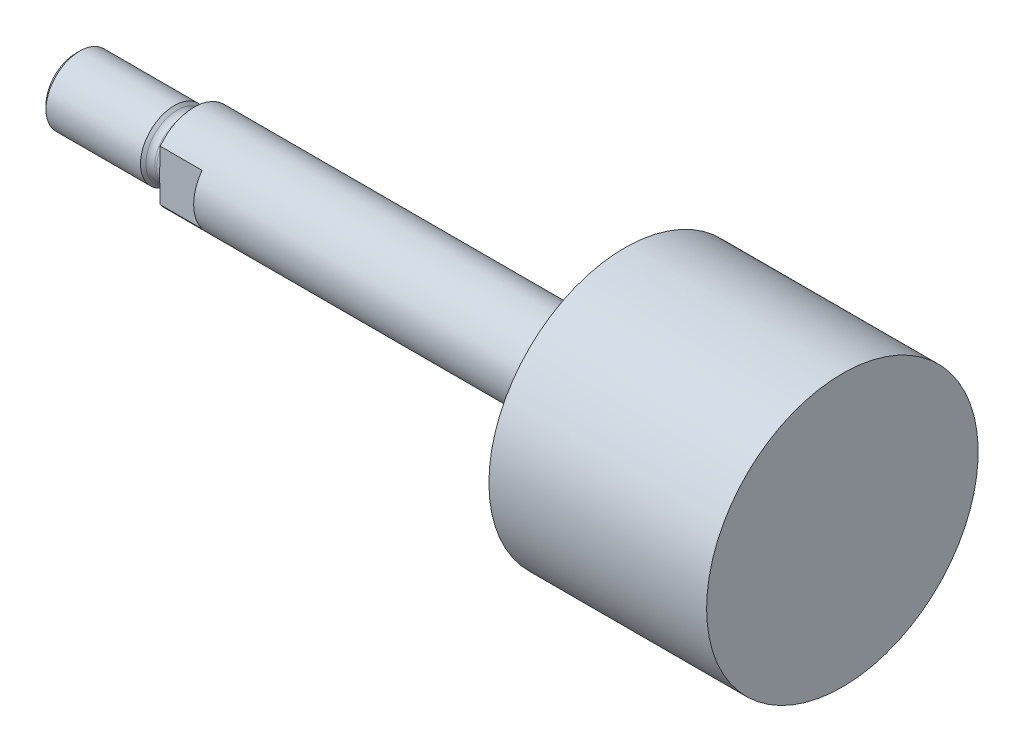
ISO-10303-21;
HEADER;
FILE_DESCRIPTION(('STEP AP214'),'2;1');
FILE_NAME('part.step','',(''),(''),'','','');
FILE_SCHEMA(('AUTOMOTIVE_DESIGN { 1 0 10303 214 1 1 1 1 }'));
ENDSEC;
DATA;
#1=APPLICATION_CONTEXT('core data for automotive mechanical design processes');
#2=APPLICATION_PROTOCOL_DEFINITION('international standard','automotive_design',2000,#1);
#3=PRODUCT_CONTEXT('',#1,'mechanical');
#4=PRODUCT('Part','Part','',(#3));
#5=PRODUCT_RELATED_PRODUCT_CATEGORY('part','',(#4));
#6=PRODUCT_DEFINITION_FORMATION('','',#4);
#7=PRODUCT_DEFINITION_CONTEXT('part definition',#1,'design');
#8=PRODUCT_DEFINITION('design','',#6,#7);
#9=PRODUCT_DEFINITION_SHAPE('','',#8);
#10=(LENGTH_UNIT() NAMED_UNIT(*) SI_UNIT(.MILLI.,.METRE.));
#11=(NAMED_UNIT(*) PLANE_ANGLE_UNIT() SI_UNIT($,.RADIAN.));
#12=(NAMED_UNIT(*) SI_UNIT($,.STERADIAN.) SOLID_ANGLE_UNIT());
#13=UNCERTAINTY_MEASURE_WITH_UNIT(LENGTH_MEASURE(1.E-05),#10,'distance_accuracy_value','');
#14=(GEOMETRIC_REPRESENTATION_CONTEXT(3) GLOBAL_UNCERTAINTY_ASSIGNED_CONTEXT((#13)) GLOBAL_UNIT_ASSIGNED_CONTEXT((#10,
#11,#12)) REPRESENTATION_CONTEXT('',''));
#15=CARTESIAN_POINT('',(0.,0.,0.));
#16=DIRECTION('',(0.,0.,1.));
#17=DIRECTION('',(1.,0.,0.));
#18=AXIS2_PLACEMENT_3D('',#15,#16,#17);
#19=CARTESIAN_POINT('',(-9.525,0.,0.));
#20=DIRECTION('',(1.,0.,0.));
#21=DIRECTION('',(0.,0.,-1.));
#22=AXIS2_PLACEMENT_3D('',#19,#20,#21);
#23=PLANE('',#22);
#24=CARTESIAN_POINT('',(-9.52500000000001,0.,0.));
#25=DIRECTION('',(-1.,0.,0.));
#26=DIRECTION('',(0.,0.,1.));
#27=AXIS2_PLACEMENT_3D('',#24,#25,#26);
#28=CIRCLE('',#27,7.9375);
#29=CARTESIAN_POINT('',(-9.52500000000001,-4.7625,-6.35));
#30=VERTEX_POINT('',#29);
#31=CARTESIAN_POINT('',(-9.52500000000001,-4.7625,6.35));
#32=VERTEX_POINT('',#31);
#33=EDGE_CURVE('E106',#30,#32,#28,.T.);
#34=ORIENTED_EDGE('',*,*,#33,.T.);
#35=DIRECTION('',(0.,1.,0.));
#36=VECTOR('',#35,1.);
#37=CARTESIAN_POINT('',(-9.525,0.,6.35));
#38=LINE('',#37,#36);
#39=CARTESIAN_POINT('',(-9.52499999999909,-2.97038855370794,6.35));
#40=VERTEX_POINT('',#39);
#41=EDGE_CURVE('E114',#32,#40,#38,.T.);
#42=ORIENTED_EDGE('',*,*,#41,.T.);
#43=CARTESIAN_POINT('',(-9.525,0.,0.));
#44=DIRECTION('',(-1.,0.,0.));
#45=DIRECTION('',(0.,0.,1.));
#46=AXIS2_PLACEMENT_3D('',#43,#44,#45);
#47=CIRCLE('',#46,7.01039999999997);
#48=CARTESIAN_POINT('',(-9.525,-2.970388553708,-6.35));
#49=VERTEX_POINT('',#48);
#50=EDGE_CURVE('E149',#49,#40,#47,.T.);
#51=ORIENTED_EDGE('',*,*,#50,.F.);
#52=DIRECTION('',(0.,-1.,0.));
#53=VECTOR('',#52,1.);
#54=CARTESIAN_POINT('',(-9.525,0.,-6.35));
#55=LINE('',#54,#53);
#56=EDGE_CURVE('E51',#49,#30,#55,.T.);
#57=ORIENTED_EDGE('',*,*,#56,.T.);
#58=EDGE_LOOP('',(#34,#42,#51,#57));
#59=FACE_BOUND('',#58,.T.);
#60=ADVANCED_FACE('F36',(#59),#23,.F.);
#61=CARTESIAN_POINT('',(-9.525,2.970388553708,6.35));
#62=VERTEX_POINT('',#61);
#63=CARTESIAN_POINT('',(-9.52499999999909,2.97038855370794,-6.35));
#64=VERTEX_POINT('',#63);
#65=EDGE_CURVE('E150',#62,#64,#47,.T.);
#66=ORIENTED_EDGE('',*,*,#65,.F.);
#67=CARTESIAN_POINT('',(-9.52500000000001,4.7625,6.35));
#68=VERTEX_POINT('',#67);
#69=EDGE_CURVE('E59',#62,#68,#38,.T.);
#70=ORIENTED_EDGE('',*,*,#69,.T.);
#71=CARTESIAN_POINT('',(-9.52500000000001,4.7625,-6.35));
#72=VERTEX_POINT('',#71);
#73=EDGE_CURVE('E147',#68,#72,#28,.T.);
#74=ORIENTED_EDGE('',*,*,#73,.T.);
#75=EDGE_CURVE('E107',#72,#64,#55,.T.);
#76=ORIENTED_EDGE('',*,*,#75,.T.);
#77=EDGE_LOOP('',(#66,#70,#74,#76));
#78=FACE_BOUND('',#77,.T.);
#79=ADVANCED_FACE('F38',(#78),#23,.F.);
#80=CARTESIAN_POINT('',(112.3442,0.,0.));
#81=DIRECTION('',(-1.,0.,0.));
#82=DIRECTION('',(0.,0.,1.));
#83=AXIS2_PLACEMENT_3D('',#80,#81,#82);
#84=CYLINDRICAL_SURFACE('',#83,7.9375);
#85=DIRECTION('',(-1.,0.,0.));
#86=VECTOR('',#85,1.);
#87=CARTESIAN_POINT('',(112.3442,4.7625,-6.35));
#88=LINE('',#87,#86);
#89=CARTESIAN_POINT('',(-1.651,4.7625,-6.35));
#90=VERTEX_POINT('',#89);
#91=EDGE_CURVE('E99',#90,#72,#88,.T.);
#92=ORIENTED_EDGE('',*,*,#91,.T.);
#93=ORIENTED_EDGE('',*,*,#73,.F.);
#94=DIRECTION('',(-1.,0.,0.));
#95=VECTOR('',#94,1.);
#96=CARTESIAN_POINT('',(112.3442,4.7625,6.35));
#97=LINE('',#96,#95);
#98=CARTESIAN_POINT('',(-1.651,4.7625,6.35));
#99=VERTEX_POINT('',#98);
#100=EDGE_CURVE('E115',#68,#99,#97,.F.);
#101=ORIENTED_EDGE('',*,*,#100,.T.);
#102=CARTESIAN_POINT('',(-1.651,0.,0.));
#103=DIRECTION('',(1.,0.,0.));
#104=DIRECTION('',(0.,0.,-1.));
#105=AXIS2_PLACEMENT_3D('',#102,#103,#104);
#106=CIRCLE('',#105,7.9375);
#107=CARTESIAN_POINT('',(-1.651,-4.7625,6.35));
#108=VERTEX_POINT('',#107);
#109=EDGE_CURVE('E11',#99,#108,#106,.T.);
#110=ORIENTED_EDGE('',*,*,#109,.T.);
#111=DIRECTION('',(-1.,0.,0.));
#112=VECTOR('',#111,1.);
#113=CARTESIAN_POINT('',(112.3442,-4.7625,6.35));
#114=LINE('',#113,#112);
#115=EDGE_CURVE('E118',#108,#32,#114,.T.);
#116=ORIENTED_EDGE('',*,*,#115,.T.);
#117=ORIENTED_EDGE('',*,*,#33,.F.);
#118=DIRECTION('',(-1.,0.,0.));
#119=VECTOR('',#118,1.);
#120=CARTESIAN_POINT('',(112.3442,-4.7625,-6.35));
#121=LINE('',#120,#119);
#122=CARTESIAN_POINT('',(-1.651,-4.7625,-6.35));
#123=VERTEX_POINT('',#122);
#124=EDGE_CURVE('E97',#30,#123,#121,.F.);
#125=ORIENTED_EDGE('',*,*,#124,.T.);
#126=EDGE_CURVE('E40',#123,#90,#106,.T.);
#127=ORIENTED_EDGE('',*,*,#126,.T.);
#128=EDGE_LOOP('',(#92,#93,#101,#110,#116,#117,#125,#127));
#129=FACE_BOUND('',#128,.T.);
#130=CARTESIAN_POINT('',(71.4248,0.,0.));
#131=DIRECTION('',(-1.,0.,0.));
#132=DIRECTION('',(0.,0.,1.));
#133=AXIS2_PLACEMENT_3D('',#130,#131,#132);
#134=CIRCLE('',#133,7.9375);
#135=CARTESIAN_POINT('',(71.4248,0.,7.9375));
#136=VERTEX_POINT('',#135);
#137=EDGE_CURVE('E144',#136,#136,#134,.T.);
#138=ORIENTED_EDGE('',*,*,#137,.T.);
#139=EDGE_LOOP('',(#138));
#140=FACE_BOUND('',#139,.T.);
#141=ADVANCED_FACE('F103',(#129,#140),#84,.T.);
#142=CARTESIAN_POINT('',(71.4248,7.9375,0.));
#143=DIRECTION('',(1.,0.,0.));
#144=DIRECTION('',(0.,0.,-1.));
#145=AXIS2_PLACEMENT_3D('',#142,#143,#144);
#146=PLANE('',#145);
#147=ORIENTED_EDGE('',*,*,#137,.F.);
#148=EDGE_LOOP('',(#147));
#149=FACE_BOUND('',#148,.T.);
#150=CARTESIAN_POINT('',(71.4248,0.,0.));
#151=DIRECTION('',(-1.,0.,0.));
#152=DIRECTION('',(0.,0.,1.));
#153=AXIS2_PLACEMENT_3D('',#150,#151,#152);
#154=CIRCLE('',#153,25.52065);
#155=CARTESIAN_POINT('',(71.4248,0.,25.52065));
#156=VERTEX_POINT('',#155);
#157=EDGE_CURVE('E141',#156,#156,#154,.T.);
#158=ORIENTED_EDGE('',*,*,#157,.T.);
#159=EDGE_LOOP('',(#158));
#160=FACE_BOUND('',#159,.T.);
#161=ADVANCED_FACE('F223',(#149,#160),#146,.F.);
#162=CARTESIAN_POINT('',(112.3442,0.,0.));
#163=DIRECTION('',(-1.,0.,0.));
#164=DIRECTION('',(0.,0.,1.));
#165=AXIS2_PLACEMENT_3D('',#162,#163,#164);
#166=CYLINDRICAL_SURFACE('',#165,25.52065);
#167=ORIENTED_EDGE('',*,*,#157,.F.);
#168=EDGE_LOOP('',(#167));
#169=FACE_BOUND('',#168,.T.);
#170=CARTESIAN_POINT('',(112.3442,0.,0.));
#171=DIRECTION('',(-1.,0.,0.));
#172=DIRECTION('',(0.,0.,1.));
#173=AXIS2_PLACEMENT_3D('',#170,#171,#172);
#174=CIRCLE('',#173,25.52065);
#175=CARTESIAN_POINT('',(112.3442,0.,25.52065));
#176=VERTEX_POINT('',#175);
#177=EDGE_CURVE('E138',#176,#176,#174,.T.);
#178=ORIENTED_EDGE('',*,*,#177,.T.);
#179=EDGE_LOOP('',(#178));
#180=FACE_BOUND('',#179,.T.);
#181=ADVANCED_FACE('F227',(#169,#180),#166,.T.);
#182=CARTESIAN_POINT('',(112.3442,25.52065,0.));
#183=DIRECTION('',(-1.,0.,0.));
#184=DIRECTION('',(0.,0.,1.));
#185=AXIS2_PLACEMENT_3D('',#182,#183,#184);
#186=PLANE('',#185);
#187=ORIENTED_EDGE('',*,*,#177,.F.);
#188=EDGE_LOOP('',(#187));
#189=FACE_BOUND('',#188,.T.);
#190=ADVANCED_FACE('F200',(#189),#186,.F.);
#191=CARTESIAN_POINT('',(-11.176,0.,0.));
#192=DIRECTION('',(-1.,0.,0.));
#193=DIRECTION('',(0.,0.,1.));
#194=AXIS2_PLACEMENT_3D('',#191,#192,#193);
#195=TOROIDAL_SURFACE('',#194,7.01039999999997,1.65099999999996);
#196=CARTESIAN_POINT('',(-11.176,0.,0.));
#197=DIRECTION('',(-1.,0.,0.));
#198=DIRECTION('',(0.,0.,1.));
#199=AXIS2_PLACEMENT_3D('',#196,#197,#198);
#200=CIRCLE('',#199,5.3594);
#201=CARTESIAN_POINT('',(-11.176,0.,5.3594));
#202=VERTEX_POINT('',#201);
#203=EDGE_CURVE('E135',#202,#202,#200,.T.);
#204=ORIENTED_EDGE('',*,*,#203,.F.);
#205=EDGE_LOOP('',(#204));
#206=FACE_BOUND('',#205,.T.);
#207=ORIENTED_EDGE('',*,*,#50,.T.);
#208=CARTESIAN_POINT('',(-9.66283350552548,0.,6.35));
#209=CARTESIAN_POINT('',(-9.66283776268165,0.137451430435917,6.35));
#210=CARTESIAN_POINT('',(-9.66086064410943,0.274901459292685,6.35));
#211=CARTESIAN_POINT('',(-9.65327512758972,0.549703593251603,6.35));
#212=CARTESIAN_POINT('',(-9.64766654215389,0.687055692931226,6.35));
#213=CARTESIAN_POINT('',(-9.63368350744831,0.961784555362044,6.35));
#214=CARTESIAN_POINT('',(-9.62530558703981,1.09916113170582,6.35));
#215=CARTESIAN_POINT('',(-9.60709506531702,1.37381514567713,6.35));
#216=CARTESIAN_POINT('',(-9.59726243721363,1.51109258143215,6.35));
#217=CARTESIAN_POINT('',(-9.57769107415581,1.78610658716269,6.35));
#218=CARTESIAN_POINT('',(-9.56795275241811,1.92384318770572,6.35));
#219=CARTESIAN_POINT('',(-9.55036706332895,2.1994349590825,6.35));
#220=CARTESIAN_POINT('',(-9.54251954822724,2.33729011980641,6.35));
#221=CARTESIAN_POINT('',(-9.53061012777387,2.61293672942961,6.35));
#222=CARTESIAN_POINT('',(-9.52654157628171,2.75072786256873,6.35));
#223=CARTESIAN_POINT('',(-9.52417014087122,3.02639632048793,6.35));
#224=CARTESIAN_POINT('',(-9.52586736602664,3.16427364684923,6.35));
#225=CARTESIAN_POINT('',(-9.53623298695597,3.41591615679577,6.35));
#226=CARTESIAN_POINT('',(-9.54364547741073,3.52972902878415,6.35));
#227=CARTESIAN_POINT('',(-9.5652722959771,3.75668651680819,6.35));
#228=CARTESIAN_POINT('',(-9.57948360173495,3.8698314071859,6.35));
#229=CARTESIAN_POINT('',(-9.61613724000463,4.09430765509806,6.35));
#230=CARTESIAN_POINT('',(-9.63854290816065,4.20564481854687,6.35));
#231=CARTESIAN_POINT('',(-9.69323725421695,4.42580807481177,6.35));
#232=CARTESIAN_POINT('',(-9.72551563503527,4.53463665746051,6.35));
#233=CARTESIAN_POINT('',(-9.80043395264561,4.74434521790355,6.35));
#234=CARTESIAN_POINT('',(-9.84265936849043,4.84537030063758,6.35));
#235=CARTESIAN_POINT('',(-9.93986578771073,5.04143487335471,6.35));
#236=CARTESIAN_POINT('',(-9.99486731550324,5.13646441596393,6.35));
#237=CARTESIAN_POINT('',(-10.1200822564968,5.31808438255421,6.35));
#238=CARTESIAN_POINT('',(-10.1904956953232,5.40453978365148,6.35));
#239=CARTESIAN_POINT('',(-10.3469450411392,5.56188873080202,6.35));
#240=CARTESIAN_POINT('',(-10.4329191525452,5.63284146617137,6.35));
#241=CARTESIAN_POINT('',(-10.5840425675886,5.72981578158812,6.35));
#242=CARTESIAN_POINT('',(-10.6448142215812,5.76269017456242,6.35));
#243=CARTESIAN_POINT('',(-10.7709599511927,5.81803002255515,6.35));
#244=CARTESIAN_POINT('',(-10.8363311031553,5.84050202217993,6.35));
#245=CARTESIAN_POINT('',(-10.9704057837701,5.87363179910374,6.35));
#246=CARTESIAN_POINT('',(-11.0391250807995,5.88422658965699,6.35));
#247=CARTESIAN_POINT('',(-11.177340641629,5.89257253132415,6.35));
#248=CARTESIAN_POINT('',(-11.2468367101593,5.89032684097418,6.35));
#249=CARTESIAN_POINT('',(-11.3787070331634,5.87387551024288,6.35));
#250=CARTESIAN_POINT('',(-11.4412061552369,5.86064135459059,6.35));
#251=CARTESIAN_POINT('',(-11.5632476514794,5.82431208557844,6.35));
#252=CARTESIAN_POINT('',(-11.6227895241345,5.8012153059669,6.35));
#253=CARTESIAN_POINT('',(-11.7403800522129,5.74515145636776,6.35));
#254=CARTESIAN_POINT('',(-11.7982335897206,5.71177873804436,6.35));
#255=CARTESIAN_POINT('',(-11.9086295249029,5.63724297521669,6.35));
#256=CARTESIAN_POINT('',(-11.9611700546148,5.59607720531773,6.35));
#257=CARTESIAN_POINT('',(-12.0874929348829,5.48357026818756,6.35));
#258=CARTESIAN_POINT('',(-12.1574533423658,5.40792695476672,6.35));
#259=CARTESIAN_POINT('',(-12.2844713443971,5.24641974614602,6.35));
#260=CARTESIAN_POINT('',(-12.3414880796921,5.16052475647974,6.35));
#261=CARTESIAN_POINT('',(-12.4707359307792,4.9347664739624,6.35));
#262=CARTESIAN_POINT('',(-12.5350669449757,4.79038507098147,6.35));
#263=CARTESIAN_POINT('',(-12.6144952020883,4.56826751975704,6.35));
#264=CARTESIAN_POINT('',(-12.638128174757,4.49329586638908,6.35));
#265=CARTESIAN_POINT('',(-12.6803779181948,4.34194457273481,6.35));
#266=CARTESIAN_POINT('',(-12.6989955499358,4.26556517652083,6.35));
#267=CARTESIAN_POINT('',(-12.7564627847762,3.99639285228688,6.35));
#268=CARTESIAN_POINT('',(-12.7836807225018,3.80111803468868,6.35));
#269=CARTESIAN_POINT('',(-12.8184318392706,3.40880994621735,6.35));
#270=CARTESIAN_POINT('',(-12.8259262725631,3.21177397598197,6.35));
#271=CARTESIAN_POINT('',(-12.8278648104876,2.81615270361075,6.35));
#272=CARTESIAN_POINT('',(-12.822203365626,2.61756769884746,6.35));
#273=CARTESIAN_POINT('',(-12.8082768260479,2.32006340067763,6.35));
#274=CARTESIAN_POINT('',(-12.8027310743218,2.22098332552986,6.35));
#275=CARTESIAN_POINT('',(-12.7905166824336,2.02288471369804,6.35));
#276=CARTESIAN_POINT('',(-12.7838479756302,1.92386618101643,6.35));
#277=CARTESIAN_POINT('',(-12.7613349514935,1.60017235724012,6.35));
#278=CARTESIAN_POINT('',(-12.7445899147175,1.37556077876289,6.35));
#279=CARTESIAN_POINT('',(-12.7230317982697,1.03842412557191,6.35));
#280=CARTESIAN_POINT('',(-12.7164394586494,0.926019432621905,6.35));
#281=CARTESIAN_POINT('',(-12.7051111639391,0.701115546286717,6.35));
#282=CARTESIAN_POINT('',(-12.7003751781763,0.588616354493737,6.35));
#283=CARTESIAN_POINT('',(-12.6932629768874,0.363473765579382,6.35));
#284=CARTESIAN_POINT('',(-12.6908881622922,0.250830322504832,6.35));
#285=CARTESIAN_POINT('',(-12.68875509809,0.0255182719448549,6.35));
#286=CARTESIAN_POINT('',(-12.6889968378574,-0.0871503354365248,6.35));
#287=CARTESIAN_POINT('',(-12.6920714763423,-0.312454087984137,6.35));
#288=CARTESIAN_POINT('',(-12.6949044477263,-0.425089232123346,6.35));
#289=CARTESIAN_POINT('',(-12.702859514925,-0.650277280111182,6.35));
#290=CARTESIAN_POINT('',(-12.7079816432833,-0.762830182767846,6.35));
#291=CARTESIAN_POINT('',(-12.7199487366169,-0.987337547246309,6.35));
#292=CARTESIAN_POINT('',(-12.7267859120841,-1.09929243839208,6.35));
#293=CARTESIAN_POINT('',(-12.7414782767011,-1.32313641851737,6.35));
#294=CARTESIAN_POINT('',(-12.7493335032882,-1.43502550492493,6.35));
#295=CARTESIAN_POINT('',(-12.7731990641829,-1.77079830212964,6.35));
#296=CARTESIAN_POINT('',(-12.7895009673345,-1.9946645733859,6.35));
#297=CARTESIAN_POINT('',(-12.8152546426155,-2.44200235728095,6.35));
#298=CARTESIAN_POINT('',(-12.824731856633,-2.66547220536156,6.35));
#299=CARTESIAN_POINT('',(-12.8285644311114,-3.11258627813859,6.35));
#300=CARTESIAN_POINT('',(-12.8229360134774,-3.33623005813547,6.35));
#301=CARTESIAN_POINT('',(-12.7957533131104,-3.67283380754169,6.35));
#302=CARTESIAN_POINT('',(-12.783320036777,-3.78650376318378,6.35));
#303=CARTESIAN_POINT('',(-12.7504854781607,-4.01266196471474,6.35));
#304=CARTESIAN_POINT('',(-12.7300889094231,-4.12515086930589,6.35));
#305=CARTESIAN_POINT('',(-12.6798834273822,-4.3470965353313,6.35));
#306=CARTESIAN_POINT('',(-12.6501525292717,-4.45657053075977,6.35));
#307=CARTESIAN_POINT('',(-12.5794709705848,-4.67174541894533,6.35));
#308=CARTESIAN_POINT('',(-12.5385385562476,-4.77745213446833,6.35));
#309=CARTESIAN_POINT('',(-12.4516351540539,-4.96532049264913,6.35));
#310=CARTESIAN_POINT('',(-12.407716610098,-5.04842137561528,6.35));
#311=CARTESIAN_POINT('',(-12.3096287719324,-5.20870266710894,6.35));
#312=CARTESIAN_POINT('',(-12.2554371656012,-5.2858696652362,6.35));
#313=CARTESIAN_POINT('',(-12.1354148508841,-5.43202630027439,6.35));
#314=CARTESIAN_POINT('',(-12.0694720967193,-5.50092545654871,6.35));
#315=CARTESIAN_POINT('',(-11.9262295337076,-5.62563283051266,6.35));
#316=CARTESIAN_POINT('',(-11.8489621166341,-5.68147724394676,6.35));
#317=CARTESIAN_POINT('',(-11.7079156806997,-5.76216217571648,6.35));
#318=CARTESIAN_POINT('',(-11.646593515351,-5.79130212879009,6.35));
#319=CARTESIAN_POINT('',(-11.5199401018597,-5.83902667369762,6.35));
#320=CARTESIAN_POINT('',(-11.4546109583345,-5.85761675500087,6.35));
#321=CARTESIAN_POINT('',(-11.3213878911029,-5.88304336115577,6.35));
#322=CARTESIAN_POINT('',(-11.2534842556745,-5.88982964849793,6.35));
#323=CARTESIAN_POINT('',(-11.1175731001094,-5.89098078699452,6.35));
#324=CARTESIAN_POINT('',(-11.0495655926506,-5.8853470491712,6.35));
#325=CARTESIAN_POINT('',(-10.9200907696854,-5.86286503384324,6.35));
#326=CARTESIAN_POINT('',(-10.8584878193056,-5.84678035988086,6.35));
#327=CARTESIAN_POINT('',(-10.7385994363608,-5.80513696231909,6.35));
#328=CARTESIAN_POINT('',(-10.68031455109,-5.7795766809701,6.35));
#329=CARTESIAN_POINT('',(-10.5642917052381,-5.71828161732367,6.35));
#330=CARTESIAN_POINT('',(-10.5068582878686,-5.68197486941694,6.35));
#331=CARTESIAN_POINT('',(-10.3976123655063,-5.60176026396359,6.35));
#332=CARTESIAN_POINT('',(-10.3458029673299,-5.55784823952845,6.35));
#333=CARTESIAN_POINT('',(-10.2197492885202,-5.43686373126916,6.35));
#334=CARTESIAN_POINT('',(-10.149821452742,-5.35528312172123,6.35));
#335=CARTESIAN_POINT('',(-10.0237833120175,-5.18206063648093,6.35));
#336=CARTESIAN_POINT('',(-9.96770968653939,-5.09039296195431,6.35));
#337=CARTESIAN_POINT('',(-9.84027609825545,-4.84784321098991,6.35));
#338=CARTESIAN_POINT('',(-9.77773645162136,-4.69236222508176,6.35));
#339=CARTESIAN_POINT('',(-9.67665394886215,-4.37406719343418,6.35));
#340=CARTESIAN_POINT('',(-9.63814724832736,-4.21124249234669,6.35));
#341=CARTESIAN_POINT('',(-9.57948258130468,-3.8819011686035,6.35));
#342=CARTESIAN_POINT('',(-9.55938898295512,-3.71537366330788,6.35));
#343=CARTESIAN_POINT('',(-9.53300586548555,-3.38116647429116,6.35));
#344=CARTESIAN_POINT('',(-9.52673257260309,-3.21348566784267,6.35));
#345=CARTESIAN_POINT('',(-9.52389368450728,-2.87751190999647,6.35));
#346=CARTESIAN_POINT('',(-9.52736299967132,-2.70921892080532,6.35));
#347=CARTESIAN_POINT('',(-9.54036574077566,-2.37285550482285,6.35));
#348=CARTESIAN_POINT('',(-9.54990116184465,-2.2047851694934,6.35));
#349=CARTESIAN_POINT('',(-9.57174049297751,-1.86677913570174,6.35));
#350=CARTESIAN_POINT('',(-9.58407680105693,-1.69684573220966,6.35));
#351=CARTESIAN_POINT('',(-9.60216542880539,-1.44190520142448,6.35));
#352=CARTESIAN_POINT('',(-9.60812600147519,-1.35691332422046,6.35));
#353=CARTESIAN_POINT('',(-9.61954733466145,-1.18688855561919,6.35));
#354=CARTESIAN_POINT('',(-9.62500805078837,-1.10185566125219,6.35));
#355=CARTESIAN_POINT('',(-9.64007476287685,-0.847506710481027,6.35));
#356=CARTESIAN_POINT('',(-9.64843102002812,-0.678110208580065,6.35));
#357=CARTESIAN_POINT('',(-9.6598074598334,-0.339141745197648,6.35));
#358=CARTESIAN_POINT('',(-9.66282825359654,-0.169569806036713,6.35));
#359=CARTESIAN_POINT('',(-9.66283350552548,0.,6.35));
#360=B_SPLINE_CURVE_WITH_KNOTS('',3,(#208,#209,#210,#211,#212,#213,#214,#215,#216,#217,#218,
#219,#220,#221,#222,#223,#224,#225,#226,#227,#228,#229,#230,#231,#232,#233,#234,#235,#236,#237,
#238,#239,#240,#241,#242,#243,#244,#245,#246,#247,#248,#249,#250,#251,#252,#253,#254,#255,#256,
#257,#258,#259,#260,#261,#262,#263,#264,#265,#266,#267,#268,#269,#270,#271,#272,#273,#274,#275,
#276,#277,#278,#279,#280,#281,#282,#283,#284,#285,#286,#287,#288,#289,#290,#291,#292,#293,#294,
#295,#296,#297,#298,#299,#300,#301,#302,#303,#304,#305,#306,#307,#308,#309,#310,#311,#312,#313,
#314,#315,#316,#317,#318,#319,#320,#321,#322,#323,#324,#325,#326,#327,#328,#329,#330,#331,#332,
#333,#334,#335,#336,#337,#338,#339,#340,#341,#342,#343,#344,#345,#346,#347,#348,#349,#350,#351,
#352,#353,#354,#355,#356,#357,#358,#359),.UNSPECIFIED.,.T.,.F.,(4,2,2,2,2,2,2,2,2,2,2,2,2,2,2,2,
2,2,2,2,2,2,2,2,2,2,2,2,2,2,2,2,2,2,2,2,2,2,2,2,2,2,2,2,2,2,2,2,2,2,2,2,2,2,2,2,2,2,2,2,2,2,2,2,
2,2,2,2,2,2,2,2,2,2,2,4),(0.,0.412339289241474,0.82469986877127,1.23757928152648,
1.65046629859163,2.06470618720891,2.47891369604228,2.89239134260297,3.30587681114709,
3.64787871847947,3.98972873293334,4.33006754206839,4.67005258674404,4.99780695703714,
5.32609154090036,5.6589202652331,5.99045513633344,6.19693216053688,6.4032791037515,
6.61071523639147,6.81810034552774,7.00888932115543,7.1997105425936,7.39932155940348,
7.59900251379466,7.90635186614279,8.21465833866274,8.68601032191178,8.92173621674306,
9.15742161922938,9.74722950164081,10.3381951676506,10.9339184971833,11.2316247306027,
11.529348637493,12.205041815419,12.5428239307086,12.8806004645301,13.2185772886789,
13.556552740329,13.8945376701643,14.2325274050839,14.5690089854144,14.9055029429119,
15.5788606415283,16.2496949359733,16.9198091112626,17.2626319612836,17.605252198235,
17.945081845498,18.2843612030263,18.5657318084249,18.8477206748317,19.1325581351394,
19.4165962281368,19.6194515274012,19.8222011769102,20.0258116462341,20.2293989848401,
20.4195682300957,20.6097687522412,20.812854409184,21.0160516896715,21.3365618817821,
21.6579117546663,22.1578306867135,22.6584999041801,23.1609127471135,23.663915152643,
24.1687222481481,24.6736954594784,25.1848376488363,25.4404385872892,25.6960622022881,
26.2048113872837,26.7135022977838),.UNSPECIFIED.);
#361=EDGE_CURVE('E95',#40,#62,#360,.T.);
#362=ORIENTED_EDGE('',*,*,#361,.T.);
#363=ORIENTED_EDGE('',*,*,#65,.T.);
#364=CARTESIAN_POINT('',(-9.66283350552548,0.,-6.35));
#365=CARTESIAN_POINT('',(-9.66283776268165,-0.137451430435917,-6.35));
#366=CARTESIAN_POINT('',(-9.66086064410943,-0.274901459292685,-6.35));
#367=CARTESIAN_POINT('',(-9.65327512758972,-0.549703593251603,-6.35));
#368=CARTESIAN_POINT('',(-9.64766654215389,-0.687055692931226,-6.35));
#369=CARTESIAN_POINT('',(-9.63368350744831,-0.961784555362044,-6.35));
#370=CARTESIAN_POINT('',(-9.62530558703981,-1.09916113170582,-6.35));
#371=CARTESIAN_POINT('',(-9.60709506531702,-1.37381514567713,-6.35));
#372=CARTESIAN_POINT('',(-9.59726243721363,-1.51109258143215,-6.35));
#373=CARTESIAN_POINT('',(-9.57769107415581,-1.78610658716269,-6.35));
#374=CARTESIAN_POINT('',(-9.56795275241811,-1.92384318770572,-6.35));
#375=CARTESIAN_POINT('',(-9.55036706332895,-2.1994349590825,-6.35));
#376=CARTESIAN_POINT('',(-9.54251954822724,-2.33729011980641,-6.35));
#377=CARTESIAN_POINT('',(-9.53061012777387,-2.61293672942961,-6.35));
#378=CARTESIAN_POINT('',(-9.52654157628171,-2.75072786256873,-6.35));
#379=CARTESIAN_POINT('',(-9.52417014087122,-3.02639632048793,-6.35));
#380=CARTESIAN_POINT('',(-9.52586736602664,-3.16427364684923,-6.35));
#381=CARTESIAN_POINT('',(-9.53623298695597,-3.41591615679577,-6.35));
#382=CARTESIAN_POINT('',(-9.54364547741073,-3.52972902878415,-6.35));
#383=CARTESIAN_POINT('',(-9.5652722959771,-3.75668651680819,-6.35));
#384=CARTESIAN_POINT('',(-9.57948360173495,-3.8698314071859,-6.35));
#385=CARTESIAN_POINT('',(-9.61613724000463,-4.09430765509806,-6.35));
#386=CARTESIAN_POINT('',(-9.63854290816065,-4.20564481854687,-6.35));
#387=CARTESIAN_POINT('',(-9.69323725421695,-4.42580807481177,-6.35));
#388=CARTESIAN_POINT('',(-9.72551563503527,-4.53463665746051,-6.35));
#389=CARTESIAN_POINT('',(-9.80043395264561,-4.74434521790355,-6.35));
#390=CARTESIAN_POINT('',(-9.84265936849043,-4.84537030063758,-6.35));
#391=CARTESIAN_POINT('',(-9.93986578771073,-5.04143487335471,-6.35));
#392=CARTESIAN_POINT('',(-9.99486731550324,-5.13646441596393,-6.35));
#393=CARTESIAN_POINT('',(-10.1200822564968,-5.31808438255421,-6.35));
#394=CARTESIAN_POINT('',(-10.1904956953232,-5.40453978365148,-6.35));
#395=CARTESIAN_POINT('',(-10.3469450411392,-5.56188873080202,-6.35));
#396=CARTESIAN_POINT('',(-10.4329191525452,-5.63284146617137,-6.35));
#397=CARTESIAN_POINT('',(-10.5840425675886,-5.72981578158812,-6.35));
#398=CARTESIAN_POINT('',(-10.6448142215812,-5.76269017456242,-6.35));
#399=CARTESIAN_POINT('',(-10.7709599511927,-5.81803002255515,-6.35));
#400=CARTESIAN_POINT('',(-10.8363311031553,-5.84050202217993,-6.35));
#401=CARTESIAN_POINT('',(-10.9704057837701,-5.87363179910374,-6.35));
#402=CARTESIAN_POINT('',(-11.0391250807995,-5.88422658965699,-6.35));
#403=CARTESIAN_POINT('',(-11.177340641629,-5.89257253132415,-6.35));
#404=CARTESIAN_POINT('',(-11.2468367101593,-5.89032684097418,-6.35));
#405=CARTESIAN_POINT('',(-11.3787070331634,-5.87387551024288,-6.35));
#406=CARTESIAN_POINT('',(-11.4412061552369,-5.86064135459059,-6.35));
#407=CARTESIAN_POINT('',(-11.5632476514794,-5.82431208557844,-6.35));
#408=CARTESIAN_POINT('',(-11.6227895241345,-5.8012153059669,-6.35));
#409=CARTESIAN_POINT('',(-11.7403800522129,-5.74515145636776,-6.35));
#410=CARTESIAN_POINT('',(-11.7982335897206,-5.71177873804436,-6.35));
#411=CARTESIAN_POINT('',(-11.9086295249029,-5.63724297521669,-6.35));
#412=CARTESIAN_POINT('',(-11.9611700546148,-5.59607720531773,-6.35));
#413=CARTESIAN_POINT('',(-12.0874929348829,-5.48357026818756,-6.35));
#414=CARTESIAN_POINT('',(-12.1574533423658,-5.40792695476672,-6.35));
#415=CARTESIAN_POINT('',(-12.2844713443971,-5.24641974614602,-6.35));
#416=CARTESIAN_POINT('',(-12.3414880796921,-5.16052475647974,-6.35));
#417=CARTESIAN_POINT('',(-12.4707359307792,-4.9347664739624,-6.35));
#418=CARTESIAN_POINT('',(-12.5350669449757,-4.79038507098147,-6.35));
#419=CARTESIAN_POINT('',(-12.6144952020883,-4.56826751975704,-6.35));
#420=CARTESIAN_POINT('',(-12.638128174757,-4.49329586638908,-6.35));
#421=CARTESIAN_POINT('',(-12.6803779181948,-4.34194457273481,-6.35));
#422=CARTESIAN_POINT('',(-12.6989955499358,-4.26556517652083,-6.35));
#423=CARTESIAN_POINT('',(-12.7564627847762,-3.99639285228688,-6.35));
#424=CARTESIAN_POINT('',(-12.7836807225018,-3.80111803468868,-6.35));
#425=CARTESIAN_POINT('',(-12.8184318392706,-3.40880994621735,-6.35));
#426=CARTESIAN_POINT('',(-12.8259262725631,-3.21177397598197,-6.35));
#427=CARTESIAN_POINT('',(-12.8278648104876,-2.81615270361075,-6.35));
#428=CARTESIAN_POINT('',(-12.822203365626,-2.61756769884746,-6.35));
#429=CARTESIAN_POINT('',(-12.8082768260479,-2.32006340067763,-6.35));
#430=CARTESIAN_POINT('',(-12.8027310743218,-2.22098332552986,-6.35));
#431=CARTESIAN_POINT('',(-12.7905166824336,-2.02288471369804,-6.35));
#432=CARTESIAN_POINT('',(-12.7838479756302,-1.92386618101643,-6.35));
#433=CARTESIAN_POINT('',(-12.7613349514935,-1.60017235724012,-6.35));
#434=CARTESIAN_POINT('',(-12.7445899147175,-1.37556077876289,-6.35));
#435=CARTESIAN_POINT('',(-12.7230317982697,-1.03842412557191,-6.35));
#436=CARTESIAN_POINT('',(-12.7164394586494,-0.926019432621905,-6.35));
#437=CARTESIAN_POINT('',(-12.7051111639391,-0.701115546286717,-6.35));
#438=CARTESIAN_POINT('',(-12.7003751781763,-0.588616354493737,-6.35));
#439=CARTESIAN_POINT('',(-12.6932629768874,-0.363473765579382,-6.35));
#440=CARTESIAN_POINT('',(-12.6908881622922,-0.250830322504832,-6.35));
#441=CARTESIAN_POINT('',(-12.68875509809,-0.0255182719448549,-6.35));
#442=CARTESIAN_POINT('',(-12.6889968378574,0.0871503354365248,-6.35));
#443=CARTESIAN_POINT('',(-12.6920714763423,0.312454087984137,-6.35));
#444=CARTESIAN_POINT('',(-12.6949044477263,0.425089232123346,-6.35));
#445=CARTESIAN_POINT('',(-12.702859514925,0.650277280111182,-6.35));
#446=CARTESIAN_POINT('',(-12.7079816432833,0.762830182767846,-6.35));
#447=CARTESIAN_POINT('',(-12.7199487366169,0.987337547246309,-6.35));
#448=CARTESIAN_POINT('',(-12.7267859120841,1.09929243839208,-6.35));
#449=CARTESIAN_POINT('',(-12.7414782767011,1.32313641851737,-6.35));
#450=CARTESIAN_POINT('',(-12.7493335032882,1.43502550492493,-6.35));
#451=CARTESIAN_POINT('',(-12.7731990641829,1.77079830212964,-6.35));
#452=CARTESIAN_POINT('',(-12.7895009673345,1.9946645733859,-6.35));
#453=CARTESIAN_POINT('',(-12.8152546426155,2.44200235728095,-6.35));
#454=CARTESIAN_POINT('',(-12.824731856633,2.66547220536156,-6.35));
#455=CARTESIAN_POINT('',(-12.8285644311114,3.11258627813859,-6.35));
#456=CARTESIAN_POINT('',(-12.8229360134774,3.33623005813547,-6.35));
#457=CARTESIAN_POINT('',(-12.7957533131104,3.67283380754169,-6.35));
#458=CARTESIAN_POINT('',(-12.783320036777,3.78650376318378,-6.35));
#459=CARTESIAN_POINT('',(-12.7504854781607,4.01266196471474,-6.35));
#460=CARTESIAN_POINT('',(-12.7300889094231,4.12515086930589,-6.35));
#461=CARTESIAN_POINT('',(-12.6798834273822,4.3470965353313,-6.35));
#462=CARTESIAN_POINT('',(-12.6501525292717,4.45657053075977,-6.35));
#463=CARTESIAN_POINT('',(-12.5794709705848,4.67174541894533,-6.35));
#464=CARTESIAN_POINT('',(-12.5385385562476,4.77745213446833,-6.35));
#465=CARTESIAN_POINT('',(-12.4516351540539,4.96532049264913,-6.35));
#466=CARTESIAN_POINT('',(-12.407716610098,5.04842137561528,-6.35));
#467=CARTESIAN_POINT('',(-12.3096287719324,5.20870266710894,-6.35));
#468=CARTESIAN_POINT('',(-12.2554371656012,5.2858696652362,-6.35));
#469=CARTESIAN_POINT('',(-12.1354148508841,5.43202630027439,-6.35));
#470=CARTESIAN_POINT('',(-12.0694720967193,5.50092545654871,-6.35));
#471=CARTESIAN_POINT('',(-11.9262295337076,5.62563283051266,-6.35));
#472=CARTESIAN_POINT('',(-11.8489621166341,5.68147724394676,-6.35));
#473=CARTESIAN_POINT('',(-11.7079156806997,5.76216217571648,-6.35));
#474=CARTESIAN_POINT('',(-11.646593515351,5.79130212879009,-6.35));
#475=CARTESIAN_POINT('',(-11.5199401018597,5.83902667369762,-6.35));
#476=CARTESIAN_POINT('',(-11.4546109583345,5.85761675500087,-6.35));
#477=CARTESIAN_POINT('',(-11.3213878911029,5.88304336115577,-6.35));
#478=CARTESIAN_POINT('',(-11.2534842556745,5.88982964849793,-6.35));
#479=CARTESIAN_POINT('',(-11.1175731001094,5.89098078699452,-6.35));
#480=CARTESIAN_POINT('',(-11.0495655926506,5.8853470491712,-6.35));
#481=CARTESIAN_POINT('',(-10.9200907696854,5.86286503384324,-6.35));
#482=CARTESIAN_POINT('',(-10.8584878193056,5.84678035988086,-6.35));
#483=CARTESIAN_POINT('',(-10.7385994363608,5.80513696231909,-6.35));
#484=CARTESIAN_POINT('',(-10.68031455109,5.7795766809701,-6.35));
#485=CARTESIAN_POINT('',(-10.5642917052381,5.71828161732367,-6.35));
#486=CARTESIAN_POINT('',(-10.5068582878686,5.68197486941694,-6.35));
#487=CARTESIAN_POINT('',(-10.3976123655063,5.60176026396359,-6.35));
#488=CARTESIAN_POINT('',(-10.3458029673299,5.55784823952845,-6.35));
#489=CARTESIAN_POINT('',(-10.2197492885202,5.43686373126916,-6.35));
#490=CARTESIAN_POINT('',(-10.149821452742,5.35528312172123,-6.35));
#491=CARTESIAN_POINT('',(-10.0237833120175,5.18206063648093,-6.35));
#492=CARTESIAN_POINT('',(-9.96770968653939,5.09039296195431,-6.35));
#493=CARTESIAN_POINT('',(-9.84027609825545,4.84784321098991,-6.35));
#494=CARTESIAN_POINT('',(-9.77773645162136,4.69236222508176,-6.35));
#495=CARTESIAN_POINT('',(-9.67665394886215,4.37406719343418,-6.35));
#496=CARTESIAN_POINT('',(-9.63814724832736,4.21124249234669,-6.35));
#497=CARTESIAN_POINT('',(-9.57948258130468,3.8819011686035,-6.35));
#498=CARTESIAN_POINT('',(-9.55938898295512,3.71537366330788,-6.35));
#499=CARTESIAN_POINT('',(-9.53300586548555,3.38116647429116,-6.35));
#500=CARTESIAN_POINT('',(-9.52673257260309,3.21348566784267,-6.35));
#501=CARTESIAN_POINT('',(-9.52389368450728,2.87751190999647,-6.35));
#502=CARTESIAN_POINT('',(-9.52736299967132,2.70921892080532,-6.35));
#503=CARTESIAN_POINT('',(-9.54036574077566,2.37285550482285,-6.35));
#504=CARTESIAN_POINT('',(-9.54990116184465,2.2047851694934,-6.35));
#505=CARTESIAN_POINT('',(-9.57174049297751,1.86677913570174,-6.35));
#506=CARTESIAN_POINT('',(-9.58407680105693,1.69684573220966,-6.35));
#507=CARTESIAN_POINT('',(-9.60216542880539,1.44190520142448,-6.35));
#508=CARTESIAN_POINT('',(-9.60812600147519,1.35691332422046,-6.35));
#509=CARTESIAN_POINT('',(-9.61954733466145,1.18688855561919,-6.35));
#510=CARTESIAN_POINT('',(-9.62500805078837,1.10185566125219,-6.35));
#511=CARTESIAN_POINT('',(-9.64007476287685,0.847506710481027,-6.35));
#512=CARTESIAN_POINT('',(-9.64843102002812,0.678110208580065,-6.35));
#513=CARTESIAN_POINT('',(-9.6598074598334,0.339141745197648,-6.35));
#514=CARTESIAN_POINT('',(-9.66282825359654,0.169569806036713,-6.35));
#515=CARTESIAN_POINT('',(-9.66283350552548,0.,-6.35));
#516=B_SPLINE_CURVE_WITH_KNOTS('',3,(#364,#365,#366,#367,#368,#369,#370,#371,#372,#373,#374,
#375,#376,#377,#378,#379,#380,#381,#382,#383,#384,#385,#386,#387,#388,#389,#390,#391,#392,#393,
#394,#395,#396,#397,#398,#399,#400,#401,#402,#403,#404,#405,#406,#407,#408,#409,#410,#411,#412,
#413,#414,#415,#416,#417,#418,#419,#420,#421,#422,#423,#424,#425,#426,#427,#428,#429,#430,#431,
#432,#433,#434,#435,#436,#437,#438,#439,#440,#441,#442,#443,#444,#445,#446,#447,#448,#449,#450,
#451,#452,#453,#454,#455,#456,#457,#458,#459,#460,#461,#462,#463,#464,#465,#466,#467,#468,#469,
#470,#471,#472,#473,#474,#475,#476,#477,#478,#479,#480,#481,#482,#483,#484,#485,#486,#487,#488,
#489,#490,#491,#492,#493,#494,#495,#496,#497,#498,#499,#500,#501,#502,#503,#504,#505,#506,#507,
#508,#509,#510,#511,#512,#513,#514,#515),.UNSPECIFIED.,.T.,.F.,(4,2,2,2,2,2,2,2,2,2,2,2,2,2,2,2,
2,2,2,2,2,2,2,2,2,2,2,2,2,2,2,2,2,2,2,2,2,2,2,2,2,2,2,2,2,2,2,2,2,2,2,2,2,2,2,2,2,2,2,2,2,2,2,2,
2,2,2,2,2,2,2,2,2,2,2,4),(0.,0.412339289241474,0.82469986877127,1.23757928152648,
1.65046629859163,2.06470618720891,2.47891369604228,2.89239134260297,3.30587681114709,
3.64787871847947,3.98972873293334,4.33006754206839,4.67005258674404,4.99780695703714,
5.32609154090036,5.6589202652331,5.99045513633344,6.19693216053688,6.4032791037515,
6.61071523639147,6.81810034552774,7.00888932115543,7.1997105425936,7.39932155940348,
7.59900251379466,7.90635186614279,8.21465833866274,8.68601032191178,8.92173621674306,
9.15742161922938,9.74722950164081,10.3381951676506,10.9339184971833,11.2316247306027,
11.529348637493,12.205041815419,12.5428239307086,12.8806004645301,13.2185772886789,
13.556552740329,13.8945376701643,14.2325274050839,14.5690089854144,14.9055029429119,
15.5788606415283,16.2496949359733,16.9198091112626,17.2626319612836,17.605252198235,
17.945081845498,18.2843612030263,18.5657318084249,18.8477206748317,19.1325581351394,
19.4165962281368,19.6194515274012,19.8222011769102,20.0258116462341,20.2293989848401,
20.4195682300957,20.6097687522412,20.812854409184,21.0160516896715,21.3365618817821,
21.6579117546663,22.1578306867135,22.6584999041801,23.1609127471135,23.663915152643,
24.1687222481481,24.6736954594784,25.1848376488363,25.4404385872892,25.6960622022881,
26.2048113872837,26.7135022977838),.UNSPECIFIED.);
#517=EDGE_CURVE('E153',#64,#49,#516,.T.);
#518=ORIENTED_EDGE('',*,*,#517,.T.);
#519=EDGE_LOOP('',(#207,#362,#363,#518));
#520=FACE_BOUND('',#519,.T.);
#521=ADVANCED_FACE('F161',(#206,#520),#195,.F.);
#522=CARTESIAN_POINT('',(-9.525,0.,0.));
#523=DIRECTION('',(-1.,0.,0.));
#524=DIRECTION('',(0.,0.,1.));
#525=AXIS2_PLACEMENT_3D('',#522,#523,#524);
#526=CYLINDRICAL_SURFACE('',#525,5.3594);
#527=CARTESIAN_POINT('',(-11.558933408522,0.,0.));
#528=DIRECTION('',(-1.,0.,0.));
#529=DIRECTION('',(0.,0.,1.));
#530=AXIS2_PLACEMENT_3D('',#527,#528,#529);
#531=CIRCLE('',#530,5.3594);
#532=CARTESIAN_POINT('',(-11.558933408522,0.,5.3594));
#533=VERTEX_POINT('',#532);
#534=EDGE_CURVE('E132',#533,#533,#531,.T.);
#535=ORIENTED_EDGE('',*,*,#534,.F.);
#536=EDGE_LOOP('',(#535));
#537=FACE_BOUND('',#536,.T.);
#538=ORIENTED_EDGE('',*,*,#203,.T.);
#539=EDGE_LOOP('',(#538));
#540=FACE_BOUND('',#539,.T.);
#541=ADVANCED_FACE('F193',(#537,#540),#526,.T.);
#542=CARTESIAN_POINT('',(-11.5589334085223,0.,0.));
#543=DIRECTION('',(-1.,0.,0.));
#544=DIRECTION('',(0.,0.,1.));
#545=AXIS2_PLACEMENT_3D('',#542,#543,#544);
#546=TOROIDAL_SURFACE('',#545,7.01039999999939,1.65099999999939);
#547=CARTESIAN_POINT('',(-12.726366704261,0.,0.));
#548=DIRECTION('',(-1.,0.,0.));
#549=DIRECTION('',(0.,0.,1.));
#550=AXIS2_PLACEMENT_3D('',#547,#548,#549);
#551=CIRCLE('',#550,5.842966704261);
#552=CARTESIAN_POINT('',(-12.726366704261,0.,5.842966704261));
#553=VERTEX_POINT('',#552);
#554=EDGE_CURVE('E129',#553,#553,#551,.T.);
#555=ORIENTED_EDGE('',*,*,#554,.F.);
#556=EDGE_LOOP('',(#555));
#557=FACE_BOUND('',#556,.T.);
#558=ORIENTED_EDGE('',*,*,#534,.T.);
#559=EDGE_LOOP('',(#558));
#560=FACE_BOUND('',#559,.T.);
#561=ADVANCED_FACE('F190',(#557,#560),#546,.F.);
#562=CARTESIAN_POINT('',(-12.726366704261,0.,0.));
#563=DIRECTION('',(-1.,0.,0.));
#564=DIRECTION('',(0.,0.,1.));
#565=AXIS2_PLACEMENT_3D('',#562,#563,#564);
#566=CONICAL_SURFACE('',#565,5.842966704261,0.78539816339745);
#567=CARTESIAN_POINT('',(-13.2334,0.,0.));
#568=DIRECTION('',(-1.,0.,0.));
#569=DIRECTION('',(0.,0.,1.));
#570=AXIS2_PLACEMENT_3D('',#567,#568,#569);
#571=CIRCLE('',#570,6.35);
#572=CARTESIAN_POINT('',(-13.2334,0.,6.35));
#573=VERTEX_POINT('',#572);
#574=EDGE_CURVE('E126',#573,#573,#571,.T.);
#575=ORIENTED_EDGE('',*,*,#574,.F.);
#576=EDGE_LOOP('',(#575));
#577=FACE_BOUND('',#576,.T.);
#578=ORIENTED_EDGE('',*,*,#554,.T.);
#579=EDGE_LOOP('',(#578));
#580=FACE_BOUND('',#579,.T.);
#581=ADVANCED_FACE('F186',(#577,#580),#566,.T.);
#582=CARTESIAN_POINT('',(-9.525,0.,0.));
#583=DIRECTION('',(-1.,0.,0.));
#584=DIRECTION('',(0.,0.,1.));
#585=AXIS2_PLACEMENT_3D('',#582,#583,#584);
#586=CYLINDRICAL_SURFACE('',#585,6.35);
#587=CARTESIAN_POINT('',(-30.99435,0.,0.));
#588=DIRECTION('',(-1.,0.,0.));
#589=DIRECTION('',(0.,0.,1.));
#590=AXIS2_PLACEMENT_3D('',#587,#588,#589);
#591=CIRCLE('',#590,6.35);
#592=CARTESIAN_POINT('',(-30.99435,0.,6.35));
#593=VERTEX_POINT('',#592);
#594=EDGE_CURVE('E123',#593,#593,#591,.T.);
#595=ORIENTED_EDGE('',*,*,#594,.F.);
#596=EDGE_LOOP('',(#595));
#597=FACE_BOUND('',#596,.T.);
#598=ORIENTED_EDGE('',*,*,#574,.T.);
#599=EDGE_LOOP('',(#598));
#600=FACE_BOUND('',#599,.T.);
#601=ADVANCED_FACE('F182',(#597,#600),#586,.T.);
#602=CARTESIAN_POINT('',(-30.99435,0.,0.));
#603=DIRECTION('',(1.,0.,0.));
#604=DIRECTION('',(0.,0.,-1.));
#605=AXIS2_PLACEMENT_3D('',#602,#603,#604);
#606=CONICAL_SURFACE('',#605,6.35,0.785398163397445);
#607=CARTESIAN_POINT('',(-31.75,0.,0.));
#608=DIRECTION('',(-1.,0.,0.));
#609=DIRECTION('',(0.,0.,1.));
#610=AXIS2_PLACEMENT_3D('',#607,#608,#609);
#611=CIRCLE('',#610,5.59435);
#612=CARTESIAN_POINT('',(-31.75,0.,5.59435));
#613=VERTEX_POINT('',#612);
#614=EDGE_CURVE('E120',#613,#613,#611,.T.);
#615=ORIENTED_EDGE('',*,*,#614,.F.);
#616=EDGE_LOOP('',(#615));
#617=FACE_BOUND('',#616,.T.);
#618=ORIENTED_EDGE('',*,*,#594,.T.);
#619=EDGE_LOOP('',(#618));
#620=FACE_BOUND('',#619,.T.);
#621=ADVANCED_FACE('F178',(#617,#620),#606,.T.);
#622=CARTESIAN_POINT('',(-31.75,0.,0.));
#623=DIRECTION('',(1.,0.,0.));
#624=DIRECTION('',(0.,0.,-1.));
#625=AXIS2_PLACEMENT_3D('',#622,#623,#624);
#626=PLANE('',#625);
#627=ORIENTED_EDGE('',*,*,#614,.T.);
#628=EDGE_LOOP('',(#627));
#629=FACE_BOUND('',#628,.T.);
#630=ADVANCED_FACE('F167',(#629),#626,.F.);
#631=CARTESIAN_POINT('',(-1.651,-7.9375,-6.35));
#632=DIRECTION('',(0.,0.,1.));
#633=DIRECTION('',(1.,0.,0.));
#634=AXIS2_PLACEMENT_3D('',#631,#632,#633);
#635=PLANE('',#634);
#636=DIRECTION('',(0.,1.,0.));
#637=VECTOR('',#636,1.);
#638=CARTESIAN_POINT('',(-1.651,-7.9375,-6.35));
#639=LINE('',#638,#637);
#640=EDGE_CURVE('E91',#123,#90,#639,.T.);
#641=ORIENTED_EDGE('',*,*,#640,.F.);
#642=ORIENTED_EDGE('',*,*,#124,.F.);
#643=ORIENTED_EDGE('',*,*,#56,.F.);
#644=ORIENTED_EDGE('',*,*,#517,.F.);
#645=ORIENTED_EDGE('',*,*,#75,.F.);
#646=ORIENTED_EDGE('',*,*,#91,.F.);
#647=EDGE_LOOP('',(#641,#642,#643,#644,#645,#646));
#648=FACE_BOUND('',#647,.T.);
#649=ADVANCED_FACE('F96',(#648),#635,.F.);
#650=CARTESIAN_POINT('',(-1.651,0.,0.));
#651=DIRECTION('',(1.,0.,0.));
#652=DIRECTION('',(0.,0.,-1.));
#653=AXIS2_PLACEMENT_3D('',#650,#651,#652);
#654=PLANE('',#653);
#655=ORIENTED_EDGE('',*,*,#640,.T.);
#656=ORIENTED_EDGE('',*,*,#126,.F.);
#657=EDGE_LOOP('',(#655,#656));
#658=FACE_BOUND('',#657,.T.);
#659=ADVANCED_FACE('F90',(#658),#654,.F.);
#660=DIRECTION('',(0.,-1.,0.));
#661=VECTOR('',#660,1.);
#662=CARTESIAN_POINT('',(-1.651,7.9375,6.35));
#663=LINE('',#662,#661);
#664=EDGE_CURVE('E100',#99,#108,#663,.T.);
#665=ORIENTED_EDGE('',*,*,#664,.T.);
#666=ORIENTED_EDGE('',*,*,#109,.F.);
#667=EDGE_LOOP('',(#665,#666));
#668=FACE_BOUND('',#667,.T.);
#669=ADVANCED_FACE('F172',(#668),#654,.F.);
#670=CARTESIAN_POINT('',(-1.651,7.9375,6.35));
#671=DIRECTION('',(0.,0.,-1.));
#672=DIRECTION('',(-1.,0.,0.));
#673=AXIS2_PLACEMENT_3D('',#670,#671,#672);
#674=PLANE('',#673);
#675=ORIENTED_EDGE('',*,*,#664,.F.);
#676=ORIENTED_EDGE('',*,*,#100,.F.);
#677=ORIENTED_EDGE('',*,*,#69,.F.);
#678=ORIENTED_EDGE('',*,*,#361,.F.);
#679=ORIENTED_EDGE('',*,*,#41,.F.);
#680=ORIENTED_EDGE('',*,*,#115,.F.);
#681=EDGE_LOOP('',(#675,#676,#677,#678,#679,#680));
#682=FACE_BOUND('',#681,.T.);
#683=ADVANCED_FACE('F168',(#682),#674,.F.);
#684=CLOSED_SHELL('',(#60,#79,#141,#161,#181,#190,#521,#541,#561,#581,#601,#621,#630,#649,#659,
#669,#683));
#685=MANIFOLD_SOLID_BREP('B2',#684);
#686=ADVANCED_BREP_SHAPE_REPRESENTATION('',(#18,#685),#14);
#687=SHAPE_DEFINITION_REPRESENTATION(#9,#686);
ENDSEC;
END-ISO-10303-21;
